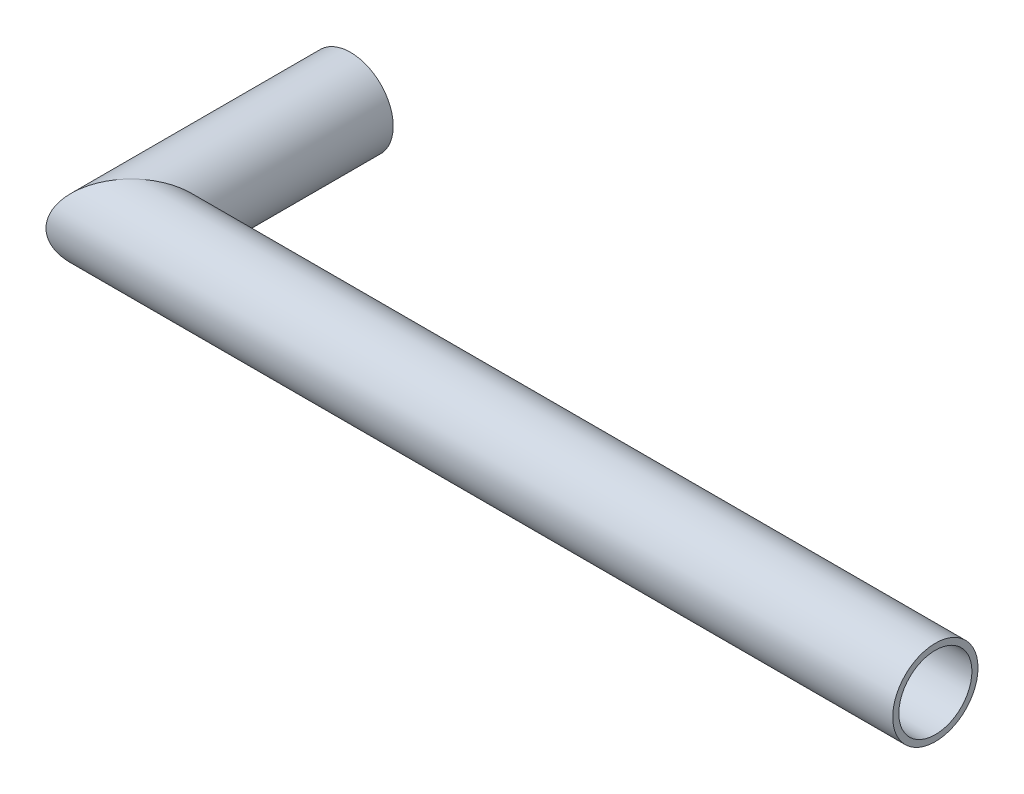
ISO-10303-21;
HEADER;
FILE_DESCRIPTION(('STEP AP214'),'2;1');
FILE_NAME('part.step','',(''),(''),'','','');
FILE_SCHEMA(('AUTOMOTIVE_DESIGN { 1 0 10303 214 1 1 1 1 }'));
ENDSEC;
DATA;
#1=APPLICATION_CONTEXT('core data for automotive mechanical design processes');
#2=APPLICATION_PROTOCOL_DEFINITION('international standard','automotive_design',2000,#1);
#3=PRODUCT_CONTEXT('',#1,'mechanical');
#4=PRODUCT('Part','Part','',(#3));
#5=PRODUCT_RELATED_PRODUCT_CATEGORY('part','',(#4));
#6=PRODUCT_DEFINITION_FORMATION('','',#4);
#7=PRODUCT_DEFINITION_CONTEXT('part definition',#1,'design');
#8=PRODUCT_DEFINITION('design','',#6,#7);
#9=PRODUCT_DEFINITION_SHAPE('','',#8);
#10=(LENGTH_UNIT() NAMED_UNIT(*) SI_UNIT(.MILLI.,.METRE.));
#11=(NAMED_UNIT(*) PLANE_ANGLE_UNIT() SI_UNIT($,.RADIAN.));
#12=(NAMED_UNIT(*) SI_UNIT($,.STERADIAN.) SOLID_ANGLE_UNIT());
#13=UNCERTAINTY_MEASURE_WITH_UNIT(LENGTH_MEASURE(1.E-05),#10,'distance_accuracy_value','');
#14=(GEOMETRIC_REPRESENTATION_CONTEXT(3) GLOBAL_UNCERTAINTY_ASSIGNED_CONTEXT((#13)) GLOBAL_UNIT_ASSIGNED_CONTEXT((#10,
#11,#12)) REPRESENTATION_CONTEXT('',''));
#15=CARTESIAN_POINT('',(0.,0.,0.));
#16=DIRECTION('',(0.,0.,1.));
#17=DIRECTION('',(1.,0.,0.));
#18=AXIS2_PLACEMENT_3D('',#15,#16,#17);
#19=CARTESIAN_POINT('',(660.,0.,0.));
#20=DIRECTION('',(1.,0.,0.));
#21=DIRECTION('',(0.,0.,-1.));
#22=AXIS2_PLACEMENT_3D('',#19,#20,#21);
#23=PLANE('',#22);
#24=CARTESIAN_POINT('',(660.,0.,0.));
#25=DIRECTION('',(1.,0.,0.));
#26=DIRECTION('',(0.,0.,-1.));
#27=AXIS2_PLACEMENT_3D('',#24,#25,#26);
#28=CIRCLE('',#27,30.);
#29=CARTESIAN_POINT('',(660.,0.,-30.));
#30=VERTEX_POINT('',#29);
#31=EDGE_CURVE('E53',#30,#30,#28,.T.);
#32=ORIENTED_EDGE('',*,*,#31,.F.);
#33=EDGE_LOOP('',(#32));
#34=FACE_BOUND('',#33,.T.);
#35=CARTESIAN_POINT('',(660.,0.,0.));
#36=DIRECTION('',(1.,0.,0.));
#37=DIRECTION('',(0.,0.,-1.));
#38=AXIS2_PLACEMENT_3D('',#35,#36,#37);
#39=CIRCLE('',#38,35.);
#40=CARTESIAN_POINT('',(660.,0.,-35.));
#41=VERTEX_POINT('',#40);
#42=EDGE_CURVE('E51',#41,#41,#39,.T.);
#43=ORIENTED_EDGE('',*,*,#42,.T.);
#44=EDGE_LOOP('',(#43));
#45=FACE_BOUND('',#44,.T.);
#46=ADVANCED_FACE('F37',(#34,#45),#23,.T.);
#47=CARTESIAN_POINT('',(0.,0.,-180.));
#48=DIRECTION('',(0.,0.,1.));
#49=DIRECTION('',(1.,0.,0.));
#50=AXIS2_PLACEMENT_3D('',#47,#48,#49);
#51=PLANE('',#50);
#52=CARTESIAN_POINT('',(0.,0.,-180.));
#53=DIRECTION('',(0.,0.,1.));
#54=DIRECTION('',(1.,0.,0.));
#55=AXIS2_PLACEMENT_3D('',#52,#53,#54);
#56=CIRCLE('',#55,30.);
#57=CARTESIAN_POINT('',(30.,0.,-180.));
#58=VERTEX_POINT('',#57);
#59=EDGE_CURVE('E62',#58,#58,#56,.T.);
#60=ORIENTED_EDGE('',*,*,#59,.T.);
#61=EDGE_LOOP('',(#60));
#62=FACE_BOUND('',#61,.T.);
#63=CARTESIAN_POINT('',(0.,0.,-180.));
#64=DIRECTION('',(0.,0.,1.));
#65=DIRECTION('',(1.,0.,0.));
#66=AXIS2_PLACEMENT_3D('',#63,#64,#65);
#67=CIRCLE('',#66,35.);
#68=CARTESIAN_POINT('',(35.,0.,-180.));
#69=VERTEX_POINT('',#68);
#70=EDGE_CURVE('E41',#69,#69,#67,.T.);
#71=ORIENTED_EDGE('',*,*,#70,.F.);
#72=EDGE_LOOP('',(#71));
#73=FACE_BOUND('',#72,.T.);
#74=ADVANCED_FACE('F77',(#62,#73),#51,.F.);
#75=CARTESIAN_POINT('',(-33.1,0.,0.));
#76=DIRECTION('',(1.,0.,0.));
#77=DIRECTION('',(0.,0.,-1.));
#78=AXIS2_PLACEMENT_3D('',#75,#76,#77);
#79=CYLINDRICAL_SURFACE('',#78,35.);
#80=CARTESIAN_POINT('',(0.,0.,0.));
#81=DIRECTION('',(0.707106781186548,0.,0.707106781186547));
#82=DIRECTION('',(-0.707106781186548,0.,0.707106781186547));
#83=AXIS2_PLACEMENT_3D('',#80,#81,#82);
#84=ELLIPSE('',#83,49.4974746830583,35.);
#85=CARTESIAN_POINT('',(-35.,0.,35.));
#86=VERTEX_POINT('',#85);
#87=EDGE_CURVE('E10',#86,#86,#84,.F.);
#88=ORIENTED_EDGE('',*,*,#87,.F.);
#89=EDGE_LOOP('',(#88));
#90=FACE_BOUND('',#89,.T.);
#91=ORIENTED_EDGE('',*,*,#42,.F.);
#92=EDGE_LOOP('',(#91));
#93=FACE_BOUND('',#92,.T.);
#94=ADVANCED_FACE('F83',(#90,#93),#79,.T.);
#95=CARTESIAN_POINT('',(0.,0.,-180.));
#96=DIRECTION('',(0.,0.,1.));
#97=DIRECTION('',(1.,0.,0.));
#98=AXIS2_PLACEMENT_3D('',#95,#96,#97);
#99=CYLINDRICAL_SURFACE('',#98,35.);
#100=ORIENTED_EDGE('',*,*,#70,.T.);
#101=EDGE_LOOP('',(#100));
#102=FACE_BOUND('',#101,.T.);
#103=ORIENTED_EDGE('',*,*,#87,.T.);
#104=EDGE_LOOP('',(#103));
#105=FACE_BOUND('',#104,.T.);
#106=ADVANCED_FACE('F39',(#102,#105),#99,.T.);
#107=CARTESIAN_POINT('',(-33.1,0.,0.));
#108=DIRECTION('',(1.,0.,0.));
#109=DIRECTION('',(0.,0.,-1.));
#110=AXIS2_PLACEMENT_3D('',#107,#108,#109);
#111=CYLINDRICAL_SURFACE('',#110,30.);
#112=CARTESIAN_POINT('',(0.,0.,0.));
#113=DIRECTION('',(0.707106781186548,0.,0.707106781186548));
#114=DIRECTION('',(-0.707106781186548,0.,0.707106781186548));
#115=AXIS2_PLACEMENT_3D('',#112,#113,#114);
#116=ELLIPSE('',#115,42.4264068711929,30.);
#117=CARTESIAN_POINT('',(-30.,0.,30.));
#118=VERTEX_POINT('',#117);
#119=EDGE_CURVE('E57',#118,#118,#116,.F.);
#120=ORIENTED_EDGE('',*,*,#119,.T.);
#121=EDGE_LOOP('',(#120));
#122=FACE_BOUND('',#121,.T.);
#123=ORIENTED_EDGE('',*,*,#31,.T.);
#124=EDGE_LOOP('',(#123));
#125=FACE_BOUND('',#124,.T.);
#126=ADVANCED_FACE('F74',(#122,#125),#111,.F.);
#127=CARTESIAN_POINT('',(0.,0.,-180.));
#128=DIRECTION('',(0.,0.,1.));
#129=DIRECTION('',(1.,0.,0.));
#130=AXIS2_PLACEMENT_3D('',#127,#128,#129);
#131=CYLINDRICAL_SURFACE('',#130,30.);
#132=ORIENTED_EDGE('',*,*,#59,.F.);
#133=EDGE_LOOP('',(#132));
#134=FACE_BOUND('',#133,.T.);
#135=ORIENTED_EDGE('',*,*,#119,.F.);
#136=EDGE_LOOP('',(#135));
#137=FACE_BOUND('',#136,.T.);
#138=ADVANCED_FACE('F79',(#134,#137),#131,.F.);
#139=CLOSED_SHELL('',(#46,#74,#94,#106,#126,#138));
#140=MANIFOLD_SOLID_BREP('B2',#139);
#141=ADVANCED_BREP_SHAPE_REPRESENTATION('',(#18,#140),#14);
#142=SHAPE_DEFINITION_REPRESENTATION(#9,#141);
ENDSEC;
END-ISO-10303-21;
